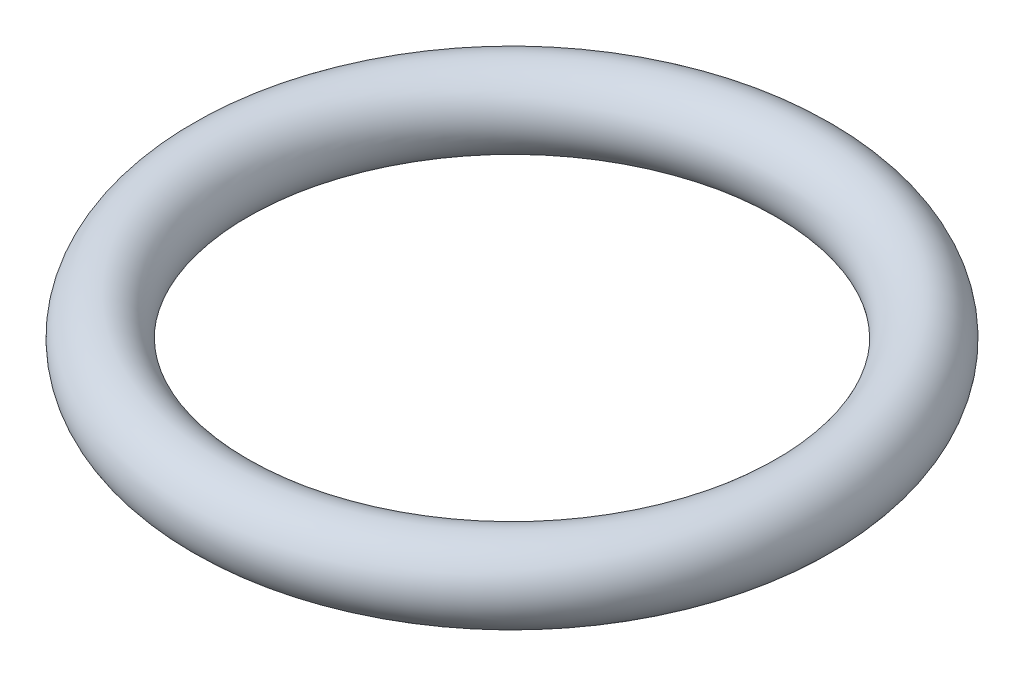
ISO-10303-21;
HEADER;
FILE_DESCRIPTION(('STEP AP214'),'2;1');
FILE_NAME('part.step','',(''),(''),'','','');
FILE_SCHEMA(('AUTOMOTIVE_DESIGN { 1 0 10303 214 1 1 1 1 }'));
ENDSEC;
DATA;
#1=APPLICATION_CONTEXT('core data for automotive mechanical design processes');
#2=APPLICATION_PROTOCOL_DEFINITION('international standard','automotive_design',2000,#1);
#3=PRODUCT_CONTEXT('',#1,'mechanical');
#4=PRODUCT('Part','Part','',(#3));
#5=PRODUCT_RELATED_PRODUCT_CATEGORY('part','',(#4));
#6=PRODUCT_DEFINITION_FORMATION('','',#4);
#7=PRODUCT_DEFINITION_CONTEXT('part definition',#1,'design');
#8=PRODUCT_DEFINITION('design','',#6,#7);
#9=PRODUCT_DEFINITION_SHAPE('','',#8);
#10=(LENGTH_UNIT() NAMED_UNIT(*) SI_UNIT(.MILLI.,.METRE.));
#11=(NAMED_UNIT(*) PLANE_ANGLE_UNIT() SI_UNIT($,.RADIAN.));
#12=(NAMED_UNIT(*) SI_UNIT($,.STERADIAN.) SOLID_ANGLE_UNIT());
#13=UNCERTAINTY_MEASURE_WITH_UNIT(LENGTH_MEASURE(1.E-05),#10,'distance_accuracy_value','');
#14=(GEOMETRIC_REPRESENTATION_CONTEXT(3) GLOBAL_UNCERTAINTY_ASSIGNED_CONTEXT((#13)) GLOBAL_UNIT_ASSIGNED_CONTEXT((#10,
#11,#12)) REPRESENTATION_CONTEXT('',''));
#15=CARTESIAN_POINT('',(0.,0.,0.));
#16=DIRECTION('',(0.,0.,1.));
#17=DIRECTION('',(1.,0.,0.));
#18=AXIS2_PLACEMENT_3D('',#15,#16,#17);
#19=CARTESIAN_POINT('',(0.,0.,0.));
#20=DIRECTION('',(0.,1.,0.));
#21=DIRECTION('',(0.,0.,1.));
#22=AXIS2_PLACEMENT_3D('',#19,#20,#21);
#23=TOROIDAL_SURFACE('',#22,19.,2.5);
#24=CARTESIAN_POINT('',(0.,0.,21.5));
#25=VERTEX_POINT('',#24);
#26=VERTEX_LOOP('',#25);
#27=FACE_BOUND('',#26,.T.);
#28=ADVANCED_FACE('F28',(#27),#23,.T.);
#29=CLOSED_SHELL('',(#28));
#30=MANIFOLD_SOLID_BREP('B2',#29);
#31=ADVANCED_BREP_SHAPE_REPRESENTATION('',(#18,#30),#14);
#32=SHAPE_DEFINITION_REPRESENTATION(#9,#31);
ENDSEC;
END-ISO-10303-21;
